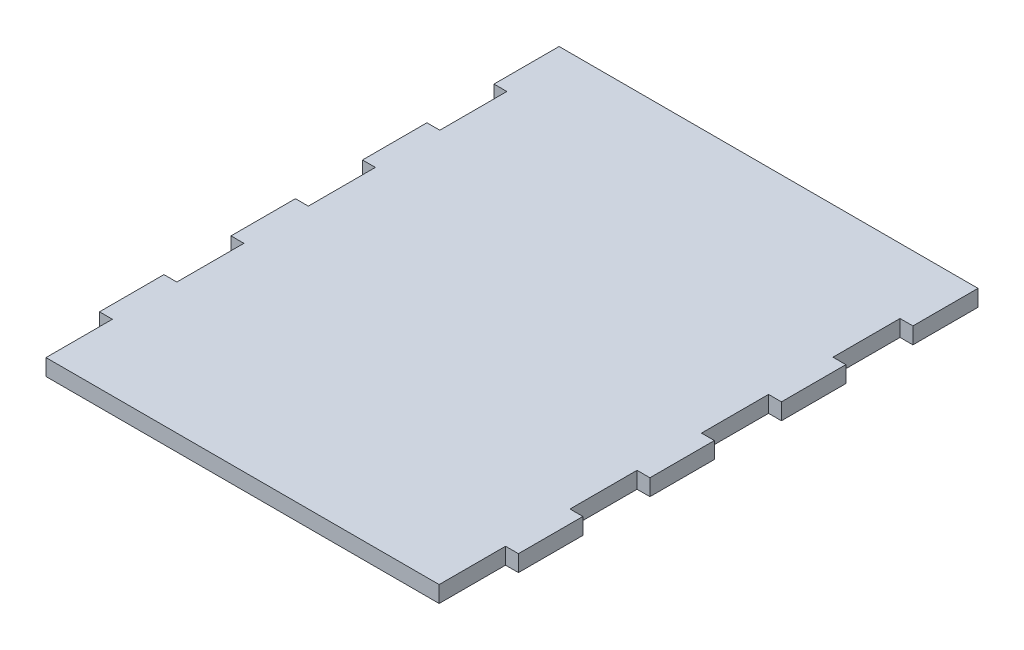
ISO-10303-21;
HEADER;
FILE_DESCRIPTION(('STEP AP214'),'2;1');
FILE_NAME('part.step','',(''),(''),'','','');
FILE_SCHEMA(('AUTOMOTIVE_DESIGN { 1 0 10303 214 1 1 1 1 }'));
ENDSEC;
DATA;
#1=APPLICATION_CONTEXT('core data for automotive mechanical design processes');
#2=APPLICATION_PROTOCOL_DEFINITION('international standard','automotive_design',2000,#1);
#3=PRODUCT_CONTEXT('',#1,'mechanical');
#4=PRODUCT('Part','Part','',(#3));
#5=PRODUCT_RELATED_PRODUCT_CATEGORY('part','',(#4));
#6=PRODUCT_DEFINITION_FORMATION('','',#4);
#7=PRODUCT_DEFINITION_CONTEXT('part definition',#1,'design');
#8=PRODUCT_DEFINITION('design','',#6,#7);
#9=PRODUCT_DEFINITION_SHAPE('','',#8);
#10=(LENGTH_UNIT() NAMED_UNIT(*) SI_UNIT(.MILLI.,.METRE.));
#11=(NAMED_UNIT(*) PLANE_ANGLE_UNIT() SI_UNIT($,.RADIAN.));
#12=(NAMED_UNIT(*) SI_UNIT($,.STERADIAN.) SOLID_ANGLE_UNIT());
#13=UNCERTAINTY_MEASURE_WITH_UNIT(LENGTH_MEASURE(1.E-05),#10,'distance_accuracy_value','');
#14=(GEOMETRIC_REPRESENTATION_CONTEXT(3) GLOBAL_UNCERTAINTY_ASSIGNED_CONTEXT((#13)) GLOBAL_UNIT_ASSIGNED_CONTEXT((#10,
#11,#12)) REPRESENTATION_CONTEXT('',''));
#15=CARTESIAN_POINT('',(0.,0.,0.));
#16=DIRECTION('',(0.,0.,1.));
#17=DIRECTION('',(1.,0.,0.));
#18=AXIS2_PLACEMENT_3D('',#15,#16,#17);
#19=CARTESIAN_POINT('',(78.6892,3.175,-101.6));
#20=DIRECTION('',(0.,0.,1.));
#21=DIRECTION('',(1.,0.,0.));
#22=AXIS2_PLACEMENT_3D('',#19,#20,#21);
#23=PLANE('',#22);
#24=DIRECTION('',(0.,1.,0.));
#25=VECTOR('',#24,1.);
#26=CARTESIAN_POINT('',(-2.36220000000002,0.,-101.6));
#27=LINE('',#26,#25);
#28=CARTESIAN_POINT('',(-2.36220000000002,0.,-101.6));
#29=VERTEX_POINT('',#28);
#30=CARTESIAN_POINT('',(-2.36220000000002,3.175,-101.6));
#31=VERTEX_POINT('',#30);
#32=EDGE_CURVE('E333',#29,#31,#27,.T.);
#33=ORIENTED_EDGE('',*,*,#32,.T.);
#34=DIRECTION('',(-1.,0.,0.));
#35=VECTOR('',#34,1.);
#36=CARTESIAN_POINT('',(78.6892,3.175,-101.6));
#37=LINE('',#36,#35);
#38=CARTESIAN_POINT('',(78.5622,3.175,-101.6));
#39=VERTEX_POINT('',#38);
#40=EDGE_CURVE('E41',#39,#31,#37,.T.);
#41=ORIENTED_EDGE('',*,*,#40,.F.);
#42=DIRECTION('',(0.,1.,0.));
#43=VECTOR('',#42,1.);
#44=CARTESIAN_POINT('',(78.5622,0.,-101.6));
#45=LINE('',#44,#43);
#46=CARTESIAN_POINT('',(78.5622,0.,-101.6));
#47=VERTEX_POINT('',#46);
#48=EDGE_CURVE('E404',#47,#39,#45,.T.);
#49=ORIENTED_EDGE('',*,*,#48,.F.);
#50=DIRECTION('',(-1.,0.,0.));
#51=VECTOR('',#50,1.);
#52=CARTESIAN_POINT('',(78.6892,0.,-101.6));
#53=LINE('',#52,#51);
#54=EDGE_CURVE('E451',#47,#29,#53,.T.);
#55=ORIENTED_EDGE('',*,*,#54,.T.);
#56=EDGE_LOOP('',(#33,#41,#49,#55));
#57=FACE_BOUND('',#56,.T.);
#58=ADVANCED_FACE('F33',(#57),#23,.F.);
#59=CARTESIAN_POINT('',(0.,3.175,0.));
#60=DIRECTION('',(0.,0.,-1.));
#61=DIRECTION('',(-1.,0.,0.));
#62=AXIS2_PLACEMENT_3D('',#59,#60,#61);
#63=PLANE('',#62);
#64=DIRECTION('',(0.,1.,0.));
#65=VECTOR('',#64,1.);
#66=CARTESIAN_POINT('',(0.127,0.,0.));
#67=LINE('',#66,#65);
#68=CARTESIAN_POINT('',(0.127,0.,0.));
#69=VERTEX_POINT('',#68);
#70=CARTESIAN_POINT('',(0.127,3.175,0.));
#71=VERTEX_POINT('',#70);
#72=EDGE_CURVE('E330',#69,#71,#67,.T.);
#73=ORIENTED_EDGE('',*,*,#72,.F.);
#74=DIRECTION('',(1.,0.,0.));
#75=VECTOR('',#74,1.);
#76=CARTESIAN_POINT('',(0.,0.,0.));
#77=LINE('',#76,#75);
#78=CARTESIAN_POINT('',(76.073,0.,0.));
#79=VERTEX_POINT('',#78);
#80=EDGE_CURVE('E36',#69,#79,#77,.T.);
#81=ORIENTED_EDGE('',*,*,#80,.T.);
#82=DIRECTION('',(0.,1.,0.));
#83=VECTOR('',#82,1.);
#84=CARTESIAN_POINT('',(76.073,0.,0.));
#85=LINE('',#84,#83);
#86=CARTESIAN_POINT('',(76.073,3.175,0.));
#87=VERTEX_POINT('',#86);
#88=EDGE_CURVE('E448',#79,#87,#85,.T.);
#89=ORIENTED_EDGE('',*,*,#88,.T.);
#90=DIRECTION('',(1.,0.,0.));
#91=VECTOR('',#90,1.);
#92=CARTESIAN_POINT('',(0.,3.175,0.));
#93=LINE('',#92,#91);
#94=EDGE_CURVE('E11',#71,#87,#93,.T.);
#95=ORIENTED_EDGE('',*,*,#94,.F.);
#96=EDGE_LOOP('',(#73,#81,#89,#95));
#97=FACE_BOUND('',#96,.T.);
#98=ADVANCED_FACE('F488',(#97),#63,.F.);
#99=CARTESIAN_POINT('',(0.,3.175,0.));
#100=DIRECTION('',(0.,1.,0.));
#101=DIRECTION('',(0.,0.,1.));
#102=AXIS2_PLACEMENT_3D('',#99,#100,#101);
#103=PLANE('',#102);
#104=DIRECTION('',(1.,0.,0.));
#105=VECTOR('',#104,1.);
#106=CARTESIAN_POINT('',(0.,3.175,-12.827));
#107=LINE('',#106,#105);
#108=CARTESIAN_POINT('',(-2.3622,3.175,-12.827));
#109=VERTEX_POINT('',#108);
#110=CARTESIAN_POINT('',(0.127,3.175,-12.827));
#111=VERTEX_POINT('',#110);
#112=EDGE_CURVE('E293',#109,#111,#107,.T.);
#113=ORIENTED_EDGE('',*,*,#112,.T.);
#114=DIRECTION('',(0.,0.,1.));
#115=VECTOR('',#114,1.);
#116=CARTESIAN_POINT('',(0.127,3.175,0.));
#117=LINE('',#116,#115);
#118=EDGE_CURVE('E255',#111,#71,#117,.T.);
#119=ORIENTED_EDGE('',*,*,#118,.T.);
#120=ORIENTED_EDGE('',*,*,#94,.T.);
#121=DIRECTION('',(0.,0.,1.));
#122=VECTOR('',#121,1.);
#123=CARTESIAN_POINT('',(76.073,3.175,0.));
#124=LINE('',#123,#122);
#125=CARTESIAN_POINT('',(76.073,3.175,-12.827));
#126=VERTEX_POINT('',#125);
#127=EDGE_CURVE('E364',#126,#87,#124,.T.);
#128=ORIENTED_EDGE('',*,*,#127,.F.);
#129=DIRECTION('',(-1.,0.,0.));
#130=VECTOR('',#129,1.);
#131=CARTESIAN_POINT('',(0.,3.175,-12.827));
#132=LINE('',#131,#130);
#133=CARTESIAN_POINT('',(78.5622,3.175,-12.827));
#134=VERTEX_POINT('',#133);
#135=EDGE_CURVE('E443',#134,#126,#132,.T.);
#136=ORIENTED_EDGE('',*,*,#135,.F.);
#137=DIRECTION('',(0.,0.,1.));
#138=VECTOR('',#137,1.);
#139=CARTESIAN_POINT('',(78.5622,3.175,0.));
#140=LINE('',#139,#138);
#141=CARTESIAN_POINT('',(78.5622,3.175,-25.273));
#142=VERTEX_POINT('',#141);
#143=EDGE_CURVE('E440',#142,#134,#140,.T.);
#144=ORIENTED_EDGE('',*,*,#143,.F.);
#145=DIRECTION('',(1.,0.,0.));
#146=VECTOR('',#145,1.);
#147=CARTESIAN_POINT('',(0.,3.175,-25.273));
#148=LINE('',#147,#146);
#149=CARTESIAN_POINT('',(76.073,3.175,-25.273));
#150=VERTEX_POINT('',#149);
#151=EDGE_CURVE('E437',#150,#142,#148,.T.);
#152=ORIENTED_EDGE('',*,*,#151,.F.);
#153=DIRECTION('',(0.,0.,1.));
#154=VECTOR('',#153,1.);
#155=CARTESIAN_POINT('',(76.073,3.175,0.));
#156=LINE('',#155,#154);
#157=CARTESIAN_POINT('',(76.073,3.175,-38.227));
#158=VERTEX_POINT('',#157);
#159=EDGE_CURVE('E434',#158,#150,#156,.T.);
#160=ORIENTED_EDGE('',*,*,#159,.F.);
#161=DIRECTION('',(-1.,0.,0.));
#162=VECTOR('',#161,1.);
#163=CARTESIAN_POINT('',(0.,3.175,-38.227));
#164=LINE('',#163,#162);
#165=CARTESIAN_POINT('',(78.5622,3.175,-38.227));
#166=VERTEX_POINT('',#165);
#167=EDGE_CURVE('E431',#166,#158,#164,.T.);
#168=ORIENTED_EDGE('',*,*,#167,.F.);
#169=DIRECTION('',(0.,0.,1.));
#170=VECTOR('',#169,1.);
#171=CARTESIAN_POINT('',(78.5622,3.175,0.));
#172=LINE('',#171,#170);
#173=CARTESIAN_POINT('',(78.5622,3.175,-50.673));
#174=VERTEX_POINT('',#173);
#175=EDGE_CURVE('E428',#174,#166,#172,.T.);
#176=ORIENTED_EDGE('',*,*,#175,.F.);
#177=DIRECTION('',(1.,0.,0.));
#178=VECTOR('',#177,1.);
#179=CARTESIAN_POINT('',(0.,3.175,-50.673));
#180=LINE('',#179,#178);
#181=CARTESIAN_POINT('',(76.073,3.175,-50.673));
#182=VERTEX_POINT('',#181);
#183=EDGE_CURVE('E425',#182,#174,#180,.T.);
#184=ORIENTED_EDGE('',*,*,#183,.F.);
#185=DIRECTION('',(0.,0.,1.));
#186=VECTOR('',#185,1.);
#187=CARTESIAN_POINT('',(76.0730000000001,3.175,0.));
#188=LINE('',#187,#186);
#189=CARTESIAN_POINT('',(76.073,3.175,-63.627));
#190=VERTEX_POINT('',#189);
#191=EDGE_CURVE('E422',#190,#182,#188,.T.);
#192=ORIENTED_EDGE('',*,*,#191,.F.);
#193=DIRECTION('',(-1.,0.,0.));
#194=VECTOR('',#193,1.);
#195=CARTESIAN_POINT('',(0.,3.175,-63.627));
#196=LINE('',#195,#194);
#197=CARTESIAN_POINT('',(78.5622,3.175,-63.627));
#198=VERTEX_POINT('',#197);
#199=EDGE_CURVE('E419',#198,#190,#196,.T.);
#200=ORIENTED_EDGE('',*,*,#199,.F.);
#201=DIRECTION('',(0.,0.,1.));
#202=VECTOR('',#201,1.);
#203=CARTESIAN_POINT('',(78.5622,3.175,0.));
#204=LINE('',#203,#202);
#205=CARTESIAN_POINT('',(78.5622,3.175,-76.073));
#206=VERTEX_POINT('',#205);
#207=EDGE_CURVE('E416',#206,#198,#204,.T.);
#208=ORIENTED_EDGE('',*,*,#207,.F.);
#209=DIRECTION('',(1.,0.,0.));
#210=VECTOR('',#209,1.);
#211=CARTESIAN_POINT('',(0.,3.175,-76.073));
#212=LINE('',#211,#210);
#213=CARTESIAN_POINT('',(76.073,3.175,-76.073));
#214=VERTEX_POINT('',#213);
#215=EDGE_CURVE('E413',#214,#206,#212,.T.);
#216=ORIENTED_EDGE('',*,*,#215,.F.);
#217=DIRECTION('',(0.,0.,1.));
#218=VECTOR('',#217,1.);
#219=CARTESIAN_POINT('',(76.073,3.175,0.));
#220=LINE('',#219,#218);
#221=CARTESIAN_POINT('',(76.073,3.175,-89.027));
#222=VERTEX_POINT('',#221);
#223=EDGE_CURVE('E410',#222,#214,#220,.T.);
#224=ORIENTED_EDGE('',*,*,#223,.F.);
#225=DIRECTION('',(-1.,0.,0.));
#226=VECTOR('',#225,1.);
#227=CARTESIAN_POINT('',(0.,3.175,-89.027));
#228=LINE('',#227,#226);
#229=CARTESIAN_POINT('',(78.5622,3.175,-89.027));
#230=VERTEX_POINT('',#229);
#231=EDGE_CURVE('E407',#230,#222,#228,.T.);
#232=ORIENTED_EDGE('',*,*,#231,.F.);
#233=DIRECTION('',(0.,0.,1.));
#234=VECTOR('',#233,1.);
#235=CARTESIAN_POINT('',(78.5622,3.175,0.));
#236=LINE('',#235,#234);
#237=EDGE_CURVE('E332',#39,#230,#236,.T.);
#238=ORIENTED_EDGE('',*,*,#237,.F.);
#239=ORIENTED_EDGE('',*,*,#40,.T.);
#240=DIRECTION('',(0.,0.,1.));
#241=VECTOR('',#240,1.);
#242=CARTESIAN_POINT('',(-2.36220000000002,3.175,0.));
#243=LINE('',#242,#241);
#244=CARTESIAN_POINT('',(-2.36220000000002,3.175,-89.027));
#245=VERTEX_POINT('',#244);
#246=EDGE_CURVE('E262',#31,#245,#243,.T.);
#247=ORIENTED_EDGE('',*,*,#246,.T.);
#248=DIRECTION('',(1.,0.,0.));
#249=VECTOR('',#248,1.);
#250=CARTESIAN_POINT('',(0.,3.175,-89.027));
#251=LINE('',#250,#249);
#252=CARTESIAN_POINT('',(0.12699999999999,3.175,-89.027));
#253=VERTEX_POINT('',#252);
#254=EDGE_CURVE('E265',#245,#253,#251,.T.);
#255=ORIENTED_EDGE('',*,*,#254,.T.);
#256=DIRECTION('',(0.,0.,1.));
#257=VECTOR('',#256,1.);
#258=CARTESIAN_POINT('',(0.12699999999999,3.175,0.));
#259=LINE('',#258,#257);
#260=CARTESIAN_POINT('',(0.12699999999999,3.175,-76.073));
#261=VERTEX_POINT('',#260);
#262=EDGE_CURVE('E325',#253,#261,#259,.T.);
#263=ORIENTED_EDGE('',*,*,#262,.T.);
#264=DIRECTION('',(-1.,0.,0.));
#265=VECTOR('',#264,1.);
#266=CARTESIAN_POINT('',(0.,3.175,-76.073));
#267=LINE('',#266,#265);
#268=CARTESIAN_POINT('',(-2.36220000000001,3.175,-76.073));
#269=VERTEX_POINT('',#268);
#270=EDGE_CURVE('E322',#261,#269,#267,.T.);
#271=ORIENTED_EDGE('',*,*,#270,.T.);
#272=DIRECTION('',(0.,0.,1.));
#273=VECTOR('',#272,1.);
#274=CARTESIAN_POINT('',(-2.36220000000001,3.175,0.));
#275=LINE('',#274,#273);
#276=CARTESIAN_POINT('',(-2.36220000000001,3.175,-63.627));
#277=VERTEX_POINT('',#276);
#278=EDGE_CURVE('E319',#269,#277,#275,.T.);
#279=ORIENTED_EDGE('',*,*,#278,.T.);
#280=DIRECTION('',(1.,0.,0.));
#281=VECTOR('',#280,1.);
#282=CARTESIAN_POINT('',(0.,3.175,-63.627));
#283=LINE('',#282,#281);
#284=CARTESIAN_POINT('',(0.126999999999993,3.175,-63.627));
#285=VERTEX_POINT('',#284);
#286=EDGE_CURVE('E316',#277,#285,#283,.T.);
#287=ORIENTED_EDGE('',*,*,#286,.T.);
#288=DIRECTION('',(0.,0.,1.));
#289=VECTOR('',#288,1.);
#290=CARTESIAN_POINT('',(0.126999999999993,3.175,0.));
#291=LINE('',#290,#289);
#292=CARTESIAN_POINT('',(0.126999999999993,3.175,-50.673));
#293=VERTEX_POINT('',#292);
#294=EDGE_CURVE('E313',#285,#293,#291,.T.);
#295=ORIENTED_EDGE('',*,*,#294,.T.);
#296=DIRECTION('',(-1.,0.,0.));
#297=VECTOR('',#296,1.);
#298=CARTESIAN_POINT('',(0.,3.175,-50.673));
#299=LINE('',#298,#297);
#300=CARTESIAN_POINT('',(-2.36220000000001,3.175,-50.673));
#301=VERTEX_POINT('',#300);
#302=EDGE_CURVE('E310',#293,#301,#299,.T.);
#303=ORIENTED_EDGE('',*,*,#302,.T.);
#304=DIRECTION('',(0.,0.,1.));
#305=VECTOR('',#304,1.);
#306=CARTESIAN_POINT('',(-2.36220000000001,3.175,0.));
#307=LINE('',#306,#305);
#308=CARTESIAN_POINT('',(-2.36220000000001,3.175,-38.227));
#309=VERTEX_POINT('',#308);
#310=EDGE_CURVE('E307',#301,#309,#307,.T.);
#311=ORIENTED_EDGE('',*,*,#310,.T.);
#312=DIRECTION('',(1.,0.,0.));
#313=VECTOR('',#312,1.);
#314=CARTESIAN_POINT('',(0.,3.175,-38.227));
#315=LINE('',#314,#313);
#316=CARTESIAN_POINT('',(0.126999999999997,3.175,-38.227));
#317=VERTEX_POINT('',#316);
#318=EDGE_CURVE('E304',#309,#317,#315,.T.);
#319=ORIENTED_EDGE('',*,*,#318,.T.);
#320=DIRECTION('',(0.,0.,1.));
#321=VECTOR('',#320,1.);
#322=CARTESIAN_POINT('',(0.126999999999997,3.175,0.));
#323=LINE('',#322,#321);
#324=CARTESIAN_POINT('',(0.126999999999997,3.175,-25.273));
#325=VERTEX_POINT('',#324);
#326=EDGE_CURVE('E301',#317,#325,#323,.T.);
#327=ORIENTED_EDGE('',*,*,#326,.T.);
#328=DIRECTION('',(-1.,0.,0.));
#329=VECTOR('',#328,1.);
#330=CARTESIAN_POINT('',(0.,3.175,-25.273));
#331=LINE('',#330,#329);
#332=CARTESIAN_POINT('',(-2.3622,3.175,-25.273));
#333=VERTEX_POINT('',#332);
#334=EDGE_CURVE('E298',#325,#333,#331,.T.);
#335=ORIENTED_EDGE('',*,*,#334,.T.);
#336=DIRECTION('',(0.,0.,1.));
#337=VECTOR('',#336,1.);
#338=CARTESIAN_POINT('',(-2.3622,3.175,0.));
#339=LINE('',#338,#337);
#340=EDGE_CURVE('E295',#333,#109,#339,.T.);
#341=ORIENTED_EDGE('',*,*,#340,.T.);
#342=EDGE_LOOP('',(#113,#119,#120,#128,#136,#144,#152,#160,#168,#176,#184,#192,#200,#208,#216,
#224,#232,#238,#239,#247,#255,#263,#271,#279,#287,#295,#303,#311,#319,#327,#335,#341));
#343=FACE_BOUND('',#342,.T.);
#344=ADVANCED_FACE('F501',(#343),#103,.T.);
#345=CARTESIAN_POINT('',(0.,0.,0.));
#346=DIRECTION('',(0.,1.,0.));
#347=DIRECTION('',(0.,0.,1.));
#348=AXIS2_PLACEMENT_3D('',#345,#346,#347);
#349=PLANE('',#348);
#350=DIRECTION('',(0.,0.,1.));
#351=VECTOR('',#350,1.);
#352=CARTESIAN_POINT('',(0.127,0.,0.));
#353=LINE('',#352,#351);
#354=CARTESIAN_POINT('',(0.127,0.,-12.827));
#355=VERTEX_POINT('',#354);
#356=EDGE_CURVE('E249',#355,#69,#353,.T.);
#357=ORIENTED_EDGE('',*,*,#356,.F.);
#358=DIRECTION('',(1.,0.,0.));
#359=VECTOR('',#358,1.);
#360=CARTESIAN_POINT('',(0.,0.,-12.827));
#361=LINE('',#360,#359);
#362=CARTESIAN_POINT('',(-2.3622,0.,-12.827));
#363=VERTEX_POINT('',#362);
#364=EDGE_CURVE('E240',#363,#355,#361,.T.);
#365=ORIENTED_EDGE('',*,*,#364,.F.);
#366=DIRECTION('',(0.,0.,1.));
#367=VECTOR('',#366,1.);
#368=CARTESIAN_POINT('',(-2.3622,0.,0.));
#369=LINE('',#368,#367);
#370=CARTESIAN_POINT('',(-2.3622,0.,-25.273));
#371=VERTEX_POINT('',#370);
#372=EDGE_CURVE('E248',#371,#363,#369,.T.);
#373=ORIENTED_EDGE('',*,*,#372,.F.);
#374=DIRECTION('',(-1.,0.,0.));
#375=VECTOR('',#374,1.);
#376=CARTESIAN_POINT('',(0.,0.,-25.273));
#377=LINE('',#376,#375);
#378=CARTESIAN_POINT('',(0.126999999999997,0.,-25.273));
#379=VERTEX_POINT('',#378);
#380=EDGE_CURVE('E269',#379,#371,#377,.T.);
#381=ORIENTED_EDGE('',*,*,#380,.F.);
#382=DIRECTION('',(0.,0.,1.));
#383=VECTOR('',#382,1.);
#384=CARTESIAN_POINT('',(0.126999999999997,0.,0.));
#385=LINE('',#384,#383);
#386=CARTESIAN_POINT('',(0.126999999999997,0.,-38.227));
#387=VERTEX_POINT('',#386);
#388=EDGE_CURVE('E271',#387,#379,#385,.T.);
#389=ORIENTED_EDGE('',*,*,#388,.F.);
#390=DIRECTION('',(1.,0.,0.));
#391=VECTOR('',#390,1.);
#392=CARTESIAN_POINT('',(0.,0.,-38.227));
#393=LINE('',#392,#391);
#394=CARTESIAN_POINT('',(-2.36220000000001,0.,-38.227));
#395=VERTEX_POINT('',#394);
#396=EDGE_CURVE('E273',#395,#387,#393,.T.);
#397=ORIENTED_EDGE('',*,*,#396,.F.);
#398=DIRECTION('',(0.,0.,1.));
#399=VECTOR('',#398,1.);
#400=CARTESIAN_POINT('',(-2.36220000000001,0.,0.));
#401=LINE('',#400,#399);
#402=CARTESIAN_POINT('',(-2.36220000000001,0.,-50.673));
#403=VERTEX_POINT('',#402);
#404=EDGE_CURVE('E275',#403,#395,#401,.T.);
#405=ORIENTED_EDGE('',*,*,#404,.F.);
#406=DIRECTION('',(-1.,0.,0.));
#407=VECTOR('',#406,1.);
#408=CARTESIAN_POINT('',(0.,0.,-50.673));
#409=LINE('',#408,#407);
#410=CARTESIAN_POINT('',(0.126999999999993,0.,-50.673));
#411=VERTEX_POINT('',#410);
#412=EDGE_CURVE('E277',#411,#403,#409,.T.);
#413=ORIENTED_EDGE('',*,*,#412,.F.);
#414=DIRECTION('',(0.,0.,1.));
#415=VECTOR('',#414,1.);
#416=CARTESIAN_POINT('',(0.126999999999993,0.,0.));
#417=LINE('',#416,#415);
#418=CARTESIAN_POINT('',(0.126999999999993,0.,-63.627));
#419=VERTEX_POINT('',#418);
#420=EDGE_CURVE('E279',#419,#411,#417,.T.);
#421=ORIENTED_EDGE('',*,*,#420,.F.);
#422=DIRECTION('',(1.,0.,0.));
#423=VECTOR('',#422,1.);
#424=CARTESIAN_POINT('',(0.,0.,-63.627));
#425=LINE('',#424,#423);
#426=CARTESIAN_POINT('',(-2.36220000000001,0.,-63.627));
#427=VERTEX_POINT('',#426);
#428=EDGE_CURVE('E281',#427,#419,#425,.T.);
#429=ORIENTED_EDGE('',*,*,#428,.F.);
#430=DIRECTION('',(0.,0.,1.));
#431=VECTOR('',#430,1.);
#432=CARTESIAN_POINT('',(-2.36220000000001,0.,0.));
#433=LINE('',#432,#431);
#434=CARTESIAN_POINT('',(-2.36220000000001,0.,-76.073));
#435=VERTEX_POINT('',#434);
#436=EDGE_CURVE('E283',#435,#427,#433,.T.);
#437=ORIENTED_EDGE('',*,*,#436,.F.);
#438=DIRECTION('',(-1.,0.,0.));
#439=VECTOR('',#438,1.);
#440=CARTESIAN_POINT('',(0.,0.,-76.073));
#441=LINE('',#440,#439);
#442=CARTESIAN_POINT('',(0.12699999999999,0.,-76.073));
#443=VERTEX_POINT('',#442);
#444=EDGE_CURVE('E285',#443,#435,#441,.T.);
#445=ORIENTED_EDGE('',*,*,#444,.F.);
#446=DIRECTION('',(0.,0.,1.));
#447=VECTOR('',#446,1.);
#448=CARTESIAN_POINT('',(0.12699999999999,0.,0.));
#449=LINE('',#448,#447);
#450=CARTESIAN_POINT('',(0.12699999999999,0.,-89.027));
#451=VERTEX_POINT('',#450);
#452=EDGE_CURVE('E287',#451,#443,#449,.T.);
#453=ORIENTED_EDGE('',*,*,#452,.F.);
#454=DIRECTION('',(1.,0.,0.));
#455=VECTOR('',#454,1.);
#456=CARTESIAN_POINT('',(0.,0.,-89.027));
#457=LINE('',#456,#455);
#458=CARTESIAN_POINT('',(-2.36220000000002,0.,-89.027));
#459=VERTEX_POINT('',#458);
#460=EDGE_CURVE('E289',#459,#451,#457,.T.);
#461=ORIENTED_EDGE('',*,*,#460,.F.);
#462=DIRECTION('',(0.,0.,1.));
#463=VECTOR('',#462,1.);
#464=CARTESIAN_POINT('',(-2.36220000000002,0.,0.));
#465=LINE('',#464,#463);
#466=EDGE_CURVE('E257',#29,#459,#465,.T.);
#467=ORIENTED_EDGE('',*,*,#466,.F.);
#468=ORIENTED_EDGE('',*,*,#54,.F.);
#469=DIRECTION('',(0.,0.,1.));
#470=VECTOR('',#469,1.);
#471=CARTESIAN_POINT('',(78.5622,0.,0.));
#472=LINE('',#471,#470);
#473=CARTESIAN_POINT('',(78.5622,0.,-89.027));
#474=VERTEX_POINT('',#473);
#475=EDGE_CURVE('E361',#47,#474,#472,.T.);
#476=ORIENTED_EDGE('',*,*,#475,.T.);
#477=DIRECTION('',(-1.,0.,0.));
#478=VECTOR('',#477,1.);
#479=CARTESIAN_POINT('',(0.,0.,-89.027));
#480=LINE('',#479,#478);
#481=CARTESIAN_POINT('',(76.073,0.,-89.027));
#482=VERTEX_POINT('',#481);
#483=EDGE_CURVE('E57',#474,#482,#480,.T.);
#484=ORIENTED_EDGE('',*,*,#483,.T.);
#485=DIRECTION('',(0.,0.,1.));
#486=VECTOR('',#485,1.);
#487=CARTESIAN_POINT('',(76.073,0.,0.));
#488=LINE('',#487,#486);
#489=CARTESIAN_POINT('',(76.073,0.,-76.073));
#490=VERTEX_POINT('',#489);
#491=EDGE_CURVE('E366',#482,#490,#488,.T.);
#492=ORIENTED_EDGE('',*,*,#491,.T.);
#493=DIRECTION('',(1.,0.,0.));
#494=VECTOR('',#493,1.);
#495=CARTESIAN_POINT('',(0.,0.,-76.073));
#496=LINE('',#495,#494);
#497=CARTESIAN_POINT('',(78.5622,0.,-76.073));
#498=VERTEX_POINT('',#497);
#499=EDGE_CURVE('E369',#490,#498,#496,.T.);
#500=ORIENTED_EDGE('',*,*,#499,.T.);
#501=DIRECTION('',(0.,0.,1.));
#502=VECTOR('',#501,1.);
#503=CARTESIAN_POINT('',(78.5622,0.,0.));
#504=LINE('',#503,#502);
#505=CARTESIAN_POINT('',(78.5622,0.,-63.627));
#506=VERTEX_POINT('',#505);
#507=EDGE_CURVE('E372',#498,#506,#504,.T.);
#508=ORIENTED_EDGE('',*,*,#507,.T.);
#509=DIRECTION('',(-1.,0.,0.));
#510=VECTOR('',#509,1.);
#511=CARTESIAN_POINT('',(0.,0.,-63.627));
#512=LINE('',#511,#510);
#513=CARTESIAN_POINT('',(76.073,0.,-63.627));
#514=VERTEX_POINT('',#513);
#515=EDGE_CURVE('E375',#506,#514,#512,.T.);
#516=ORIENTED_EDGE('',*,*,#515,.T.);
#517=DIRECTION('',(0.,0.,1.));
#518=VECTOR('',#517,1.);
#519=CARTESIAN_POINT('',(76.0730000000001,0.,0.));
#520=LINE('',#519,#518);
#521=CARTESIAN_POINT('',(76.073,0.,-50.673));
#522=VERTEX_POINT('',#521);
#523=EDGE_CURVE('E378',#514,#522,#520,.T.);
#524=ORIENTED_EDGE('',*,*,#523,.T.);
#525=DIRECTION('',(1.,0.,0.));
#526=VECTOR('',#525,1.);
#527=CARTESIAN_POINT('',(0.,0.,-50.673));
#528=LINE('',#527,#526);
#529=CARTESIAN_POINT('',(78.5622,0.,-50.673));
#530=VERTEX_POINT('',#529);
#531=EDGE_CURVE('E381',#522,#530,#528,.T.);
#532=ORIENTED_EDGE('',*,*,#531,.T.);
#533=DIRECTION('',(0.,0.,1.));
#534=VECTOR('',#533,1.);
#535=CARTESIAN_POINT('',(78.5622,0.,0.));
#536=LINE('',#535,#534);
#537=CARTESIAN_POINT('',(78.5622,0.,-38.227));
#538=VERTEX_POINT('',#537);
#539=EDGE_CURVE('E384',#530,#538,#536,.T.);
#540=ORIENTED_EDGE('',*,*,#539,.T.);
#541=DIRECTION('',(-1.,0.,0.));
#542=VECTOR('',#541,1.);
#543=CARTESIAN_POINT('',(0.,0.,-38.227));
#544=LINE('',#543,#542);
#545=CARTESIAN_POINT('',(76.073,0.,-38.227));
#546=VERTEX_POINT('',#545);
#547=EDGE_CURVE('E387',#538,#546,#544,.T.);
#548=ORIENTED_EDGE('',*,*,#547,.T.);
#549=DIRECTION('',(0.,0.,1.));
#550=VECTOR('',#549,1.);
#551=CARTESIAN_POINT('',(76.073,0.,0.));
#552=LINE('',#551,#550);
#553=CARTESIAN_POINT('',(76.073,0.,-25.273));
#554=VERTEX_POINT('',#553);
#555=EDGE_CURVE('E390',#546,#554,#552,.T.);
#556=ORIENTED_EDGE('',*,*,#555,.T.);
#557=DIRECTION('',(1.,0.,0.));
#558=VECTOR('',#557,1.);
#559=CARTESIAN_POINT('',(0.,0.,-25.273));
#560=LINE('',#559,#558);
#561=CARTESIAN_POINT('',(78.5622,0.,-25.273));
#562=VERTEX_POINT('',#561);
#563=EDGE_CURVE('E393',#554,#562,#560,.T.);
#564=ORIENTED_EDGE('',*,*,#563,.T.);
#565=DIRECTION('',(0.,0.,1.));
#566=VECTOR('',#565,1.);
#567=CARTESIAN_POINT('',(78.5622,0.,0.));
#568=LINE('',#567,#566);
#569=CARTESIAN_POINT('',(78.5622,0.,-12.827));
#570=VERTEX_POINT('',#569);
#571=EDGE_CURVE('E396',#562,#570,#568,.T.);
#572=ORIENTED_EDGE('',*,*,#571,.T.);
#573=DIRECTION('',(-1.,0.,0.));
#574=VECTOR('',#573,1.);
#575=CARTESIAN_POINT('',(0.,0.,-12.827));
#576=LINE('',#575,#574);
#577=CARTESIAN_POINT('',(76.073,0.,-12.827));
#578=VERTEX_POINT('',#577);
#579=EDGE_CURVE('E399',#570,#578,#576,.T.);
#580=ORIENTED_EDGE('',*,*,#579,.T.);
#581=DIRECTION('',(0.,0.,1.));
#582=VECTOR('',#581,1.);
#583=CARTESIAN_POINT('',(76.073,0.,0.));
#584=LINE('',#583,#582);
#585=EDGE_CURVE('E402',#578,#79,#584,.T.);
#586=ORIENTED_EDGE('',*,*,#585,.T.);
#587=ORIENTED_EDGE('',*,*,#80,.F.);
#588=EDGE_LOOP('',(#357,#365,#373,#381,#389,#397,#405,#413,#421,#429,#437,#445,#453,#461,#467,
#468,#476,#484,#492,#500,#508,#516,#524,#532,#540,#548,#556,#564,#572,#580,#586,#587));
#589=FACE_BOUND('',#588,.T.);
#590=ADVANCED_FACE('F260',(#589),#349,.F.);
#591=CARTESIAN_POINT('',(76.073,0.,0.));
#592=DIRECTION('',(-1.,0.,0.));
#593=DIRECTION('',(0.,0.,1.));
#594=AXIS2_PLACEMENT_3D('',#591,#592,#593);
#595=PLANE('',#594);
#596=ORIENTED_EDGE('',*,*,#127,.T.);
#597=ORIENTED_EDGE('',*,*,#88,.F.);
#598=ORIENTED_EDGE('',*,*,#585,.F.);
#599=DIRECTION('',(0.,1.,0.));
#600=VECTOR('',#599,1.);
#601=CARTESIAN_POINT('',(76.073,0.,-12.827));
#602=LINE('',#601,#600);
#603=EDGE_CURVE('E452',#578,#126,#602,.T.);
#604=ORIENTED_EDGE('',*,*,#603,.T.);
#605=EDGE_LOOP('',(#596,#597,#598,#604));
#606=FACE_BOUND('',#605,.T.);
#607=ADVANCED_FACE('F492',(#606),#595,.F.);
#608=CARTESIAN_POINT('',(0.,0.,-12.827));
#609=DIRECTION('',(0.,0.,-1.));
#610=DIRECTION('',(-1.,0.,0.));
#611=AXIS2_PLACEMENT_3D('',#608,#609,#610);
#612=PLANE('',#611);
#613=ORIENTED_EDGE('',*,*,#135,.T.);
#614=ORIENTED_EDGE('',*,*,#603,.F.);
#615=ORIENTED_EDGE('',*,*,#579,.F.);
#616=DIRECTION('',(0.,1.,0.));
#617=VECTOR('',#616,1.);
#618=CARTESIAN_POINT('',(78.5622,0.,-12.827));
#619=LINE('',#618,#617);
#620=EDGE_CURVE('E454',#570,#134,#619,.T.);
#621=ORIENTED_EDGE('',*,*,#620,.T.);
#622=EDGE_LOOP('',(#613,#614,#615,#621));
#623=FACE_BOUND('',#622,.T.);
#624=ADVANCED_FACE('F497',(#623),#612,.F.);
#625=CARTESIAN_POINT('',(78.5622,0.,0.));
#626=DIRECTION('',(-1.,0.,0.));
#627=DIRECTION('',(0.,0.,1.));
#628=AXIS2_PLACEMENT_3D('',#625,#626,#627);
#629=PLANE('',#628);
#630=ORIENTED_EDGE('',*,*,#143,.T.);
#631=ORIENTED_EDGE('',*,*,#620,.F.);
#632=ORIENTED_EDGE('',*,*,#571,.F.);
#633=DIRECTION('',(0.,1.,0.));
#634=VECTOR('',#633,1.);
#635=CARTESIAN_POINT('',(78.5622,0.,-25.273));
#636=LINE('',#635,#634);
#637=EDGE_CURVE('E456',#562,#142,#636,.T.);
#638=ORIENTED_EDGE('',*,*,#637,.T.);
#639=EDGE_LOOP('',(#630,#631,#632,#638));
#640=FACE_BOUND('',#639,.T.);
#641=ADVANCED_FACE('F611',(#640),#629,.F.);
#642=CARTESIAN_POINT('',(0.,0.,-25.273));
#643=DIRECTION('',(0.,0.,1.));
#644=DIRECTION('',(1.,0.,0.));
#645=AXIS2_PLACEMENT_3D('',#642,#643,#644);
#646=PLANE('',#645);
#647=ORIENTED_EDGE('',*,*,#151,.T.);
#648=ORIENTED_EDGE('',*,*,#637,.F.);
#649=ORIENTED_EDGE('',*,*,#563,.F.);
#650=DIRECTION('',(0.,1.,0.));
#651=VECTOR('',#650,1.);
#652=CARTESIAN_POINT('',(76.073,0.,-25.273));
#653=LINE('',#652,#651);
#654=EDGE_CURVE('E458',#554,#150,#653,.T.);
#655=ORIENTED_EDGE('',*,*,#654,.T.);
#656=EDGE_LOOP('',(#647,#648,#649,#655));
#657=FACE_BOUND('',#656,.T.);
#658=ADVANCED_FACE('F609',(#657),#646,.F.);
#659=CARTESIAN_POINT('',(76.073,0.,0.));
#660=DIRECTION('',(-1.,0.,0.));
#661=DIRECTION('',(0.,0.,1.));
#662=AXIS2_PLACEMENT_3D('',#659,#660,#661);
#663=PLANE('',#662);
#664=ORIENTED_EDGE('',*,*,#159,.T.);
#665=ORIENTED_EDGE('',*,*,#654,.F.);
#666=ORIENTED_EDGE('',*,*,#555,.F.);
#667=DIRECTION('',(0.,1.,0.));
#668=VECTOR('',#667,1.);
#669=CARTESIAN_POINT('',(76.073,0.,-38.227));
#670=LINE('',#669,#668);
#671=EDGE_CURVE('E460',#546,#158,#670,.T.);
#672=ORIENTED_EDGE('',*,*,#671,.T.);
#673=EDGE_LOOP('',(#664,#665,#666,#672));
#674=FACE_BOUND('',#673,.T.);
#675=ADVANCED_FACE('F605',(#674),#663,.F.);
#676=CARTESIAN_POINT('',(0.,0.,-38.227));
#677=DIRECTION('',(0.,0.,-1.));
#678=DIRECTION('',(-1.,0.,0.));
#679=AXIS2_PLACEMENT_3D('',#676,#677,#678);
#680=PLANE('',#679);
#681=ORIENTED_EDGE('',*,*,#167,.T.);
#682=ORIENTED_EDGE('',*,*,#671,.F.);
#683=ORIENTED_EDGE('',*,*,#547,.F.);
#684=DIRECTION('',(0.,1.,0.));
#685=VECTOR('',#684,1.);
#686=CARTESIAN_POINT('',(78.5622,0.,-38.227));
#687=LINE('',#686,#685);
#688=EDGE_CURVE('E462',#538,#166,#687,.T.);
#689=ORIENTED_EDGE('',*,*,#688,.T.);
#690=EDGE_LOOP('',(#681,#682,#683,#689));
#691=FACE_BOUND('',#690,.T.);
#692=ADVANCED_FACE('F601',(#691),#680,.F.);
#693=CARTESIAN_POINT('',(78.5622,0.,0.));
#694=DIRECTION('',(-1.,0.,0.));
#695=DIRECTION('',(0.,0.,1.));
#696=AXIS2_PLACEMENT_3D('',#693,#694,#695);
#697=PLANE('',#696);
#698=ORIENTED_EDGE('',*,*,#175,.T.);
#699=ORIENTED_EDGE('',*,*,#688,.F.);
#700=ORIENTED_EDGE('',*,*,#539,.F.);
#701=DIRECTION('',(0.,1.,0.));
#702=VECTOR('',#701,1.);
#703=CARTESIAN_POINT('',(78.5622,0.,-50.673));
#704=LINE('',#703,#702);
#705=EDGE_CURVE('E464',#530,#174,#704,.T.);
#706=ORIENTED_EDGE('',*,*,#705,.T.);
#707=EDGE_LOOP('',(#698,#699,#700,#706));
#708=FACE_BOUND('',#707,.T.);
#709=ADVANCED_FACE('F597',(#708),#697,.F.);
#710=CARTESIAN_POINT('',(0.,0.,-50.673));
#711=DIRECTION('',(0.,0.,1.));
#712=DIRECTION('',(1.,0.,0.));
#713=AXIS2_PLACEMENT_3D('',#710,#711,#712);
#714=PLANE('',#713);
#715=ORIENTED_EDGE('',*,*,#183,.T.);
#716=ORIENTED_EDGE('',*,*,#705,.F.);
#717=ORIENTED_EDGE('',*,*,#531,.F.);
#718=DIRECTION('',(0.,1.,0.));
#719=VECTOR('',#718,1.);
#720=CARTESIAN_POINT('',(76.073,0.,-50.673));
#721=LINE('',#720,#719);
#722=EDGE_CURVE('E466',#522,#182,#721,.T.);
#723=ORIENTED_EDGE('',*,*,#722,.T.);
#724=EDGE_LOOP('',(#715,#716,#717,#723));
#725=FACE_BOUND('',#724,.T.);
#726=ADVANCED_FACE('F593',(#725),#714,.F.);
#727=CARTESIAN_POINT('',(76.0730000000001,0.,0.));
#728=DIRECTION('',(-1.,0.,0.));
#729=DIRECTION('',(0.,0.,1.));
#730=AXIS2_PLACEMENT_3D('',#727,#728,#729);
#731=PLANE('',#730);
#732=ORIENTED_EDGE('',*,*,#191,.T.);
#733=ORIENTED_EDGE('',*,*,#722,.F.);
#734=ORIENTED_EDGE('',*,*,#523,.F.);
#735=DIRECTION('',(0.,1.,0.));
#736=VECTOR('',#735,1.);
#737=CARTESIAN_POINT('',(76.073,0.,-63.627));
#738=LINE('',#737,#736);
#739=EDGE_CURVE('E468',#514,#190,#738,.T.);
#740=ORIENTED_EDGE('',*,*,#739,.T.);
#741=EDGE_LOOP('',(#732,#733,#734,#740));
#742=FACE_BOUND('',#741,.T.);
#743=ADVANCED_FACE('F589',(#742),#731,.F.);
#744=CARTESIAN_POINT('',(0.,0.,-63.627));
#745=DIRECTION('',(0.,0.,-1.));
#746=DIRECTION('',(-1.,0.,0.));
#747=AXIS2_PLACEMENT_3D('',#744,#745,#746);
#748=PLANE('',#747);
#749=ORIENTED_EDGE('',*,*,#199,.T.);
#750=ORIENTED_EDGE('',*,*,#739,.F.);
#751=ORIENTED_EDGE('',*,*,#515,.F.);
#752=DIRECTION('',(0.,1.,0.));
#753=VECTOR('',#752,1.);
#754=CARTESIAN_POINT('',(78.5622,0.,-63.627));
#755=LINE('',#754,#753);
#756=EDGE_CURVE('E470',#506,#198,#755,.T.);
#757=ORIENTED_EDGE('',*,*,#756,.T.);
#758=EDGE_LOOP('',(#749,#750,#751,#757));
#759=FACE_BOUND('',#758,.T.);
#760=ADVANCED_FACE('F585',(#759),#748,.F.);
#761=CARTESIAN_POINT('',(78.5622,0.,0.));
#762=DIRECTION('',(-1.,0.,0.));
#763=DIRECTION('',(0.,0.,1.));
#764=AXIS2_PLACEMENT_3D('',#761,#762,#763);
#765=PLANE('',#764);
#766=ORIENTED_EDGE('',*,*,#207,.T.);
#767=ORIENTED_EDGE('',*,*,#756,.F.);
#768=ORIENTED_EDGE('',*,*,#507,.F.);
#769=DIRECTION('',(0.,1.,0.));
#770=VECTOR('',#769,1.);
#771=CARTESIAN_POINT('',(78.5622,0.,-76.073));
#772=LINE('',#771,#770);
#773=EDGE_CURVE('E472',#498,#206,#772,.T.);
#774=ORIENTED_EDGE('',*,*,#773,.T.);
#775=EDGE_LOOP('',(#766,#767,#768,#774));
#776=FACE_BOUND('',#775,.T.);
#777=ADVANCED_FACE('F581',(#776),#765,.F.);
#778=CARTESIAN_POINT('',(0.,0.,-76.073));
#779=DIRECTION('',(0.,0.,1.));
#780=DIRECTION('',(1.,0.,0.));
#781=AXIS2_PLACEMENT_3D('',#778,#779,#780);
#782=PLANE('',#781);
#783=ORIENTED_EDGE('',*,*,#215,.T.);
#784=ORIENTED_EDGE('',*,*,#773,.F.);
#785=ORIENTED_EDGE('',*,*,#499,.F.);
#786=DIRECTION('',(0.,1.,0.));
#787=VECTOR('',#786,1.);
#788=CARTESIAN_POINT('',(76.073,0.,-76.073));
#789=LINE('',#788,#787);
#790=EDGE_CURVE('E474',#490,#214,#789,.T.);
#791=ORIENTED_EDGE('',*,*,#790,.T.);
#792=EDGE_LOOP('',(#783,#784,#785,#791));
#793=FACE_BOUND('',#792,.T.);
#794=ADVANCED_FACE('F578',(#793),#782,.F.);
#795=CARTESIAN_POINT('',(76.073,0.,0.));
#796=DIRECTION('',(-1.,0.,0.));
#797=DIRECTION('',(0.,0.,1.));
#798=AXIS2_PLACEMENT_3D('',#795,#796,#797);
#799=PLANE('',#798);
#800=ORIENTED_EDGE('',*,*,#223,.T.);
#801=ORIENTED_EDGE('',*,*,#790,.F.);
#802=ORIENTED_EDGE('',*,*,#491,.F.);
#803=DIRECTION('',(0.,1.,0.));
#804=VECTOR('',#803,1.);
#805=CARTESIAN_POINT('',(76.073,0.,-89.027));
#806=LINE('',#805,#804);
#807=EDGE_CURVE('E476',#482,#222,#806,.T.);
#808=ORIENTED_EDGE('',*,*,#807,.T.);
#809=EDGE_LOOP('',(#800,#801,#802,#808));
#810=FACE_BOUND('',#809,.T.);
#811=ADVANCED_FACE('F574',(#810),#799,.F.);
#812=CARTESIAN_POINT('',(0.,0.,-89.027));
#813=DIRECTION('',(0.,0.,-1.));
#814=DIRECTION('',(-1.,0.,0.));
#815=AXIS2_PLACEMENT_3D('',#812,#813,#814);
#816=PLANE('',#815);
#817=ORIENTED_EDGE('',*,*,#231,.T.);
#818=ORIENTED_EDGE('',*,*,#807,.F.);
#819=ORIENTED_EDGE('',*,*,#483,.F.);
#820=DIRECTION('',(0.,1.,0.));
#821=VECTOR('',#820,1.);
#822=CARTESIAN_POINT('',(78.5622,0.,-89.027));
#823=LINE('',#822,#821);
#824=EDGE_CURVE('E478',#474,#230,#823,.T.);
#825=ORIENTED_EDGE('',*,*,#824,.T.);
#826=EDGE_LOOP('',(#817,#818,#819,#825));
#827=FACE_BOUND('',#826,.T.);
#828=ADVANCED_FACE('F571',(#827),#816,.F.);
#829=CARTESIAN_POINT('',(78.5622,0.,0.));
#830=DIRECTION('',(-1.,0.,0.));
#831=DIRECTION('',(0.,0.,1.));
#832=AXIS2_PLACEMENT_3D('',#829,#830,#831);
#833=PLANE('',#832);
#834=ORIENTED_EDGE('',*,*,#237,.T.);
#835=ORIENTED_EDGE('',*,*,#824,.F.);
#836=ORIENTED_EDGE('',*,*,#475,.F.);
#837=ORIENTED_EDGE('',*,*,#48,.T.);
#838=EDGE_LOOP('',(#834,#835,#836,#837));
#839=FACE_BOUND('',#838,.T.);
#840=ADVANCED_FACE('F565',(#839),#833,.F.);
#841=CARTESIAN_POINT('',(0.127,0.,0.));
#842=DIRECTION('',(-1.,0.,0.));
#843=DIRECTION('',(0.,0.,1.));
#844=AXIS2_PLACEMENT_3D('',#841,#842,#843);
#845=PLANE('',#844);
#846=ORIENTED_EDGE('',*,*,#118,.F.);
#847=DIRECTION('',(0.,1.,0.));
#848=VECTOR('',#847,1.);
#849=CARTESIAN_POINT('',(0.127,0.,-12.827));
#850=LINE('',#849,#848);
#851=EDGE_CURVE('E243',#355,#111,#850,.T.);
#852=ORIENTED_EDGE('',*,*,#851,.F.);
#853=ORIENTED_EDGE('',*,*,#356,.T.);
#854=ORIENTED_EDGE('',*,*,#72,.T.);
#855=EDGE_LOOP('',(#846,#852,#853,#854));
#856=FACE_BOUND('',#855,.T.);
#857=ADVANCED_FACE('F252',(#856),#845,.T.);
#858=CARTESIAN_POINT('',(-2.36220000000002,0.,0.));
#859=DIRECTION('',(-1.,0.,0.));
#860=DIRECTION('',(0.,0.,1.));
#861=AXIS2_PLACEMENT_3D('',#858,#859,#860);
#862=PLANE('',#861);
#863=ORIENTED_EDGE('',*,*,#246,.F.);
#864=ORIENTED_EDGE('',*,*,#32,.F.);
#865=ORIENTED_EDGE('',*,*,#466,.T.);
#866=DIRECTION('',(0.,1.,0.));
#867=VECTOR('',#866,1.);
#868=CARTESIAN_POINT('',(-2.36220000000002,0.,-89.027));
#869=LINE('',#868,#867);
#870=EDGE_CURVE('E336',#459,#245,#869,.T.);
#871=ORIENTED_EDGE('',*,*,#870,.T.);
#872=EDGE_LOOP('',(#863,#864,#865,#871));
#873=FACE_BOUND('',#872,.T.);
#874=ADVANCED_FACE('F563',(#873),#862,.T.);
#875=CARTESIAN_POINT('',(0.,0.,-89.027));
#876=DIRECTION('',(0.,0.,1.));
#877=DIRECTION('',(1.,0.,0.));
#878=AXIS2_PLACEMENT_3D('',#875,#876,#877);
#879=PLANE('',#878);
#880=ORIENTED_EDGE('',*,*,#254,.F.);
#881=ORIENTED_EDGE('',*,*,#870,.F.);
#882=ORIENTED_EDGE('',*,*,#460,.T.);
#883=DIRECTION('',(0.,1.,0.));
#884=VECTOR('',#883,1.);
#885=CARTESIAN_POINT('',(0.12699999999999,0.,-89.027));
#886=LINE('',#885,#884);
#887=EDGE_CURVE('E338',#451,#253,#886,.T.);
#888=ORIENTED_EDGE('',*,*,#887,.T.);
#889=EDGE_LOOP('',(#880,#881,#882,#888));
#890=FACE_BOUND('',#889,.T.);
#891=ADVANCED_FACE('F560',(#890),#879,.T.);
#892=CARTESIAN_POINT('',(0.12699999999999,0.,0.));
#893=DIRECTION('',(-1.,0.,0.));
#894=DIRECTION('',(0.,0.,1.));
#895=AXIS2_PLACEMENT_3D('',#892,#893,#894);
#896=PLANE('',#895);
#897=ORIENTED_EDGE('',*,*,#262,.F.);
#898=ORIENTED_EDGE('',*,*,#887,.F.);
#899=ORIENTED_EDGE('',*,*,#452,.T.);
#900=DIRECTION('',(0.,1.,0.));
#901=VECTOR('',#900,1.);
#902=CARTESIAN_POINT('',(0.12699999999999,0.,-76.073));
#903=LINE('',#902,#901);
#904=EDGE_CURVE('E340',#443,#261,#903,.T.);
#905=ORIENTED_EDGE('',*,*,#904,.T.);
#906=EDGE_LOOP('',(#897,#898,#899,#905));
#907=FACE_BOUND('',#906,.T.);
#908=ADVANCED_FACE('F557',(#907),#896,.T.);
#909=CARTESIAN_POINT('',(0.,0.,-76.073));
#910=DIRECTION('',(0.,0.,-1.));
#911=DIRECTION('',(-1.,0.,0.));
#912=AXIS2_PLACEMENT_3D('',#909,#910,#911);
#913=PLANE('',#912);
#914=ORIENTED_EDGE('',*,*,#270,.F.);
#915=ORIENTED_EDGE('',*,*,#904,.F.);
#916=ORIENTED_EDGE('',*,*,#444,.T.);
#917=DIRECTION('',(0.,1.,0.));
#918=VECTOR('',#917,1.);
#919=CARTESIAN_POINT('',(-2.36220000000001,0.,-76.073));
#920=LINE('',#919,#918);
#921=EDGE_CURVE('E342',#435,#269,#920,.T.);
#922=ORIENTED_EDGE('',*,*,#921,.T.);
#923=EDGE_LOOP('',(#914,#915,#916,#922));
#924=FACE_BOUND('',#923,.T.);
#925=ADVANCED_FACE('F549',(#924),#913,.T.);
#926=CARTESIAN_POINT('',(-2.36220000000001,0.,0.));
#927=DIRECTION('',(-1.,0.,0.));
#928=DIRECTION('',(0.,0.,1.));
#929=AXIS2_PLACEMENT_3D('',#926,#927,#928);
#930=PLANE('',#929);
#931=ORIENTED_EDGE('',*,*,#278,.F.);
#932=ORIENTED_EDGE('',*,*,#921,.F.);
#933=ORIENTED_EDGE('',*,*,#436,.T.);
#934=DIRECTION('',(0.,1.,0.));
#935=VECTOR('',#934,1.);
#936=CARTESIAN_POINT('',(-2.36220000000001,0.,-63.627));
#937=LINE('',#936,#935);
#938=EDGE_CURVE('E344',#427,#277,#937,.T.);
#939=ORIENTED_EDGE('',*,*,#938,.T.);
#940=EDGE_LOOP('',(#931,#932,#933,#939));
#941=FACE_BOUND('',#940,.T.);
#942=ADVANCED_FACE('F545',(#941),#930,.T.);
#943=CARTESIAN_POINT('',(0.,0.,-63.627));
#944=DIRECTION('',(0.,0.,1.));
#945=DIRECTION('',(1.,0.,0.));
#946=AXIS2_PLACEMENT_3D('',#943,#944,#945);
#947=PLANE('',#946);
#948=ORIENTED_EDGE('',*,*,#286,.F.);
#949=ORIENTED_EDGE('',*,*,#938,.F.);
#950=ORIENTED_EDGE('',*,*,#428,.T.);
#951=DIRECTION('',(0.,1.,0.));
#952=VECTOR('',#951,1.);
#953=CARTESIAN_POINT('',(0.126999999999993,0.,-63.627));
#954=LINE('',#953,#952);
#955=EDGE_CURVE('E346',#419,#285,#954,.T.);
#956=ORIENTED_EDGE('',*,*,#955,.T.);
#957=EDGE_LOOP('',(#948,#949,#950,#956));
#958=FACE_BOUND('',#957,.T.);
#959=ADVANCED_FACE('F542',(#958),#947,.T.);
#960=CARTESIAN_POINT('',(0.126999999999993,0.,0.));
#961=DIRECTION('',(-1.,0.,0.));
#962=DIRECTION('',(0.,0.,1.));
#963=AXIS2_PLACEMENT_3D('',#960,#961,#962);
#964=PLANE('',#963);
#965=ORIENTED_EDGE('',*,*,#294,.F.);
#966=ORIENTED_EDGE('',*,*,#955,.F.);
#967=ORIENTED_EDGE('',*,*,#420,.T.);
#968=DIRECTION('',(0.,1.,0.));
#969=VECTOR('',#968,1.);
#970=CARTESIAN_POINT('',(0.126999999999993,0.,-50.673));
#971=LINE('',#970,#969);
#972=EDGE_CURVE('E348',#411,#293,#971,.T.);
#973=ORIENTED_EDGE('',*,*,#972,.T.);
#974=EDGE_LOOP('',(#965,#966,#967,#973));
#975=FACE_BOUND('',#974,.T.);
#976=ADVANCED_FACE('F534',(#975),#964,.T.);
#977=CARTESIAN_POINT('',(0.,0.,-50.673));
#978=DIRECTION('',(0.,0.,-1.));
#979=DIRECTION('',(-1.,0.,0.));
#980=AXIS2_PLACEMENT_3D('',#977,#978,#979);
#981=PLANE('',#980);
#982=ORIENTED_EDGE('',*,*,#302,.F.);
#983=ORIENTED_EDGE('',*,*,#972,.F.);
#984=ORIENTED_EDGE('',*,*,#412,.T.);
#985=DIRECTION('',(0.,1.,0.));
#986=VECTOR('',#985,1.);
#987=CARTESIAN_POINT('',(-2.36220000000001,0.,-50.673));
#988=LINE('',#987,#986);
#989=EDGE_CURVE('E350',#403,#301,#988,.T.);
#990=ORIENTED_EDGE('',*,*,#989,.T.);
#991=EDGE_LOOP('',(#982,#983,#984,#990));
#992=FACE_BOUND('',#991,.T.);
#993=ADVANCED_FACE('F530',(#992),#981,.T.);
#994=CARTESIAN_POINT('',(-2.36220000000001,0.,0.));
#995=DIRECTION('',(-1.,0.,0.));
#996=DIRECTION('',(0.,0.,1.));
#997=AXIS2_PLACEMENT_3D('',#994,#995,#996);
#998=PLANE('',#997);
#999=ORIENTED_EDGE('',*,*,#310,.F.);
#1000=ORIENTED_EDGE('',*,*,#989,.F.);
#1001=ORIENTED_EDGE('',*,*,#404,.T.);
#1002=DIRECTION('',(0.,1.,0.));
#1003=VECTOR('',#1002,1.);
#1004=CARTESIAN_POINT('',(-2.36220000000001,0.,-38.227));
#1005=LINE('',#1004,#1003);
#1006=EDGE_CURVE('E352',#395,#309,#1005,.T.);
#1007=ORIENTED_EDGE('',*,*,#1006,.T.);
#1008=EDGE_LOOP('',(#999,#1000,#1001,#1007));
#1009=FACE_BOUND('',#1008,.T.);
#1010=ADVANCED_FACE('F527',(#1009),#998,.T.);
#1011=CARTESIAN_POINT('',(0.,0.,-38.227));
#1012=DIRECTION('',(0.,0.,1.));
#1013=DIRECTION('',(1.,0.,0.));
#1014=AXIS2_PLACEMENT_3D('',#1011,#1012,#1013);
#1015=PLANE('',#1014);
#1016=ORIENTED_EDGE('',*,*,#318,.F.);
#1017=ORIENTED_EDGE('',*,*,#1006,.F.);
#1018=ORIENTED_EDGE('',*,*,#396,.T.);
#1019=DIRECTION('',(0.,1.,0.));
#1020=VECTOR('',#1019,1.);
#1021=CARTESIAN_POINT('',(0.126999999999997,0.,-38.227));
#1022=LINE('',#1021,#1020);
#1023=EDGE_CURVE('E354',#387,#317,#1022,.T.);
#1024=ORIENTED_EDGE('',*,*,#1023,.T.);
#1025=EDGE_LOOP('',(#1016,#1017,#1018,#1024));
#1026=FACE_BOUND('',#1025,.T.);
#1027=ADVANCED_FACE('F519',(#1026),#1015,.T.);
#1028=CARTESIAN_POINT('',(0.126999999999997,0.,0.));
#1029=DIRECTION('',(-1.,0.,0.));
#1030=DIRECTION('',(0.,0.,1.));
#1031=AXIS2_PLACEMENT_3D('',#1028,#1029,#1030);
#1032=PLANE('',#1031);
#1033=ORIENTED_EDGE('',*,*,#326,.F.);
#1034=ORIENTED_EDGE('',*,*,#1023,.F.);
#1035=ORIENTED_EDGE('',*,*,#388,.T.);
#1036=DIRECTION('',(0.,1.,0.));
#1037=VECTOR('',#1036,1.);
#1038=CARTESIAN_POINT('',(0.126999999999997,0.,-25.273));
#1039=LINE('',#1038,#1037);
#1040=EDGE_CURVE('E356',#379,#325,#1039,.T.);
#1041=ORIENTED_EDGE('',*,*,#1040,.T.);
#1042=EDGE_LOOP('',(#1033,#1034,#1035,#1041));
#1043=FACE_BOUND('',#1042,.T.);
#1044=ADVANCED_FACE('F515',(#1043),#1032,.T.);
#1045=CARTESIAN_POINT('',(0.,0.,-25.273));
#1046=DIRECTION('',(0.,0.,-1.));
#1047=DIRECTION('',(-1.,0.,0.));
#1048=AXIS2_PLACEMENT_3D('',#1045,#1046,#1047);
#1049=PLANE('',#1048);
#1050=ORIENTED_EDGE('',*,*,#334,.F.);
#1051=ORIENTED_EDGE('',*,*,#1040,.F.);
#1052=ORIENTED_EDGE('',*,*,#380,.T.);
#1053=DIRECTION('',(0.,1.,0.));
#1054=VECTOR('',#1053,1.);
#1055=CARTESIAN_POINT('',(-2.3622,0.,-25.273));
#1056=LINE('',#1055,#1054);
#1057=EDGE_CURVE('E358',#371,#333,#1056,.T.);
#1058=ORIENTED_EDGE('',*,*,#1057,.T.);
#1059=EDGE_LOOP('',(#1050,#1051,#1052,#1058));
#1060=FACE_BOUND('',#1059,.T.);
#1061=ADVANCED_FACE('F512',(#1060),#1049,.T.);
#1062=CARTESIAN_POINT('',(-2.3622,0.,0.));
#1063=DIRECTION('',(-1.,0.,0.));
#1064=DIRECTION('',(0.,0.,1.));
#1065=AXIS2_PLACEMENT_3D('',#1062,#1063,#1064);
#1066=PLANE('',#1065);
#1067=ORIENTED_EDGE('',*,*,#340,.F.);
#1068=ORIENTED_EDGE('',*,*,#1057,.F.);
#1069=ORIENTED_EDGE('',*,*,#372,.T.);
#1070=DIRECTION('',(0.,1.,0.));
#1071=VECTOR('',#1070,1.);
#1072=CARTESIAN_POINT('',(-2.3622,0.,-12.827));
#1073=LINE('',#1072,#1071);
#1074=EDGE_CURVE('E49',#363,#109,#1073,.T.);
#1075=ORIENTED_EDGE('',*,*,#1074,.T.);
#1076=EDGE_LOOP('',(#1067,#1068,#1069,#1075));
#1077=FACE_BOUND('',#1076,.T.);
#1078=ADVANCED_FACE('F506',(#1077),#1066,.T.);
#1079=CARTESIAN_POINT('',(0.,0.,-12.827));
#1080=DIRECTION('',(0.,0.,1.));
#1081=DIRECTION('',(1.,0.,0.));
#1082=AXIS2_PLACEMENT_3D('',#1079,#1080,#1081);
#1083=PLANE('',#1082);
#1084=ORIENTED_EDGE('',*,*,#112,.F.);
#1085=ORIENTED_EDGE('',*,*,#1074,.F.);
#1086=ORIENTED_EDGE('',*,*,#364,.T.);
#1087=ORIENTED_EDGE('',*,*,#851,.T.);
#1088=EDGE_LOOP('',(#1084,#1085,#1086,#1087));
#1089=FACE_BOUND('',#1088,.T.);
#1090=ADVANCED_FACE('F242',(#1089),#1083,.T.);
#1091=CLOSED_SHELL('',(#58,#98,#344,#590,#607,#624,#641,#658,#675,#692,#709,#726,#743,#760,#777,
#794,#811,#828,#840,#857,#874,#891,#908,#925,#942,#959,#976,#993,#1010,#1027,#1044,#1061,#1078,#1090));
#1092=MANIFOLD_SOLID_BREP('B2',#1091);
#1093=ADVANCED_BREP_SHAPE_REPRESENTATION('',(#18,#1092),#14);
#1094=SHAPE_DEFINITION_REPRESENTATION(#9,#1093);
ENDSEC;
END-ISO-10303-21;
